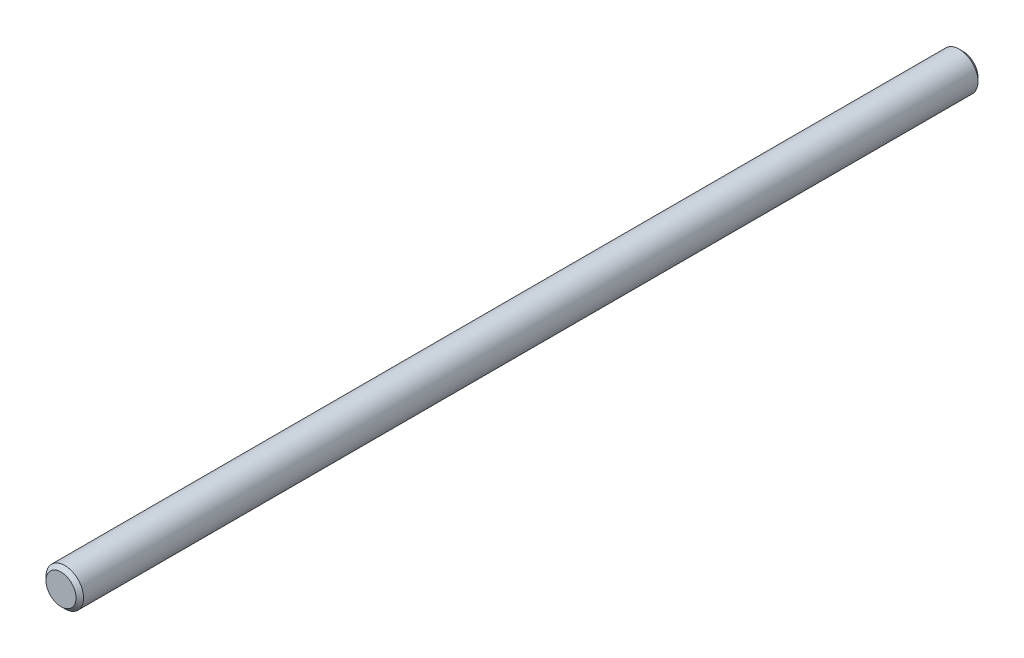
ISO-10303-21;
HEADER;
FILE_DESCRIPTION(('STEP AP214'),'2;1');
FILE_NAME('part.step','',(''),(''),'','','');
FILE_SCHEMA(('AUTOMOTIVE_DESIGN { 1 0 10303 214 1 1 1 1 }'));
ENDSEC;
DATA;
#1=APPLICATION_CONTEXT('core data for automotive mechanical design processes');
#2=APPLICATION_PROTOCOL_DEFINITION('international standard','automotive_design',2000,#1);
#3=PRODUCT_CONTEXT('',#1,'mechanical');
#4=PRODUCT('Part','Part','',(#3));
#5=PRODUCT_RELATED_PRODUCT_CATEGORY('part','',(#4));
#6=PRODUCT_DEFINITION_FORMATION('','',#4);
#7=PRODUCT_DEFINITION_CONTEXT('part definition',#1,'design');
#8=PRODUCT_DEFINITION('design','',#6,#7);
#9=PRODUCT_DEFINITION_SHAPE('','',#8);
#10=(LENGTH_UNIT() NAMED_UNIT(*) SI_UNIT(.MILLI.,.METRE.));
#11=(NAMED_UNIT(*) PLANE_ANGLE_UNIT() SI_UNIT($,.RADIAN.));
#12=(NAMED_UNIT(*) SI_UNIT($,.STERADIAN.) SOLID_ANGLE_UNIT());
#13=UNCERTAINTY_MEASURE_WITH_UNIT(LENGTH_MEASURE(1.E-05),#10,'distance_accuracy_value','');
#14=(GEOMETRIC_REPRESENTATION_CONTEXT(3) GLOBAL_UNCERTAINTY_ASSIGNED_CONTEXT((#13)) GLOBAL_UNIT_ASSIGNED_CONTEXT((#10,
#11,#12)) REPRESENTATION_CONTEXT('',''));
#15=CARTESIAN_POINT('',(0.,0.,0.));
#16=DIRECTION('',(0.,0.,1.));
#17=DIRECTION('',(1.,0.,0.));
#18=AXIS2_PLACEMENT_3D('',#15,#16,#17);
#19=CARTESIAN_POINT('',(0.,0.,76.2));
#20=DIRECTION('',(0.,0.,-1.));
#21=DIRECTION('',(-1.,0.,0.));
#22=AXIS2_PLACEMENT_3D('',#19,#20,#21);
#23=CYLINDRICAL_SURFACE('',#22,3.175);
#24=CARTESIAN_POINT('',(0.,0.,-75.5649999999999));
#25=DIRECTION('',(0.,0.,1.));
#26=DIRECTION('',(1.,0.,0.));
#27=AXIS2_PLACEMENT_3D('',#24,#25,#26);
#28=CIRCLE('',#27,3.175);
#29=CARTESIAN_POINT('',(3.175,0.,-75.5649999999999));
#30=VERTEX_POINT('',#29);
#31=EDGE_CURVE('E46',#30,#30,#28,.T.);
#32=ORIENTED_EDGE('',*,*,#31,.T.);
#33=EDGE_LOOP('',(#32));
#34=FACE_BOUND('',#33,.T.);
#35=CARTESIAN_POINT('',(0.,0.,75.5650000000001));
#36=DIRECTION('',(0.,0.,1.));
#37=DIRECTION('',(1.,0.,0.));
#38=AXIS2_PLACEMENT_3D('',#35,#36,#37);
#39=CIRCLE('',#38,3.175);
#40=CARTESIAN_POINT('',(3.175,0.,75.5650000000001));
#41=VERTEX_POINT('',#40);
#42=EDGE_CURVE('E50',#41,#41,#39,.F.);
#43=ORIENTED_EDGE('',*,*,#42,.T.);
#44=EDGE_LOOP('',(#43));
#45=FACE_BOUND('',#44,.T.);
#46=ADVANCED_FACE('F35',(#34,#45),#23,.T.);
#47=CARTESIAN_POINT('',(0.,0.,76.2));
#48=DIRECTION('',(0.,0.,1.));
#49=DIRECTION('',(1.,0.,0.));
#50=AXIS2_PLACEMENT_3D('',#47,#48,#49);
#51=PLANE('',#50);
#52=CARTESIAN_POINT('',(0.,0.,76.2));
#53=DIRECTION('',(0.,0.,1.));
#54=DIRECTION('',(1.,0.,0.));
#55=AXIS2_PLACEMENT_3D('',#52,#53,#54);
#56=CIRCLE('',#55,2.54000000000008);
#57=CARTESIAN_POINT('',(2.54000000000008,0.,76.2));
#58=VERTEX_POINT('',#57);
#59=EDGE_CURVE('E10',#58,#58,#56,.T.);
#60=ORIENTED_EDGE('',*,*,#59,.T.);
#61=EDGE_LOOP('',(#60));
#62=FACE_BOUND('',#61,.T.);
#63=ADVANCED_FACE('F66',(#62),#51,.T.);
#64=CARTESIAN_POINT('',(0.,0.,-76.2));
#65=DIRECTION('',(0.,0.,1.));
#66=DIRECTION('',(1.,0.,0.));
#67=AXIS2_PLACEMENT_3D('',#64,#65,#66);
#68=PLANE('',#67);
#69=CARTESIAN_POINT('',(0.,0.,-76.2));
#70=DIRECTION('',(0.,0.,1.));
#71=DIRECTION('',(1.,0.,0.));
#72=AXIS2_PLACEMENT_3D('',#69,#70,#71);
#73=CIRCLE('',#72,2.53999999999988);
#74=CARTESIAN_POINT('',(2.53999999999988,0.,-76.2));
#75=VERTEX_POINT('',#74);
#76=EDGE_CURVE('E42',#75,#75,#73,.F.);
#77=ORIENTED_EDGE('',*,*,#76,.T.);
#78=EDGE_LOOP('',(#77));
#79=FACE_BOUND('',#78,.T.);
#80=ADVANCED_FACE('F63',(#79),#68,.F.);
#81=CARTESIAN_POINT('',(0.,0.,-75.5649999999999));
#82=DIRECTION('',(0.,0.,1.));
#83=DIRECTION('',(1.,0.,0.));
#84=AXIS2_PLACEMENT_3D('',#81,#82,#83);
#85=CONICAL_SURFACE('',#84,3.175,0.78539816339744);
#86=ORIENTED_EDGE('',*,*,#76,.F.);
#87=EDGE_LOOP('',(#86));
#88=FACE_BOUND('',#87,.T.);
#89=ORIENTED_EDGE('',*,*,#31,.F.);
#90=EDGE_LOOP('',(#89));
#91=FACE_BOUND('',#90,.T.);
#92=ADVANCED_FACE('F59',(#88,#91),#85,.T.);
#93=CARTESIAN_POINT('',(0.,0.,76.2));
#94=DIRECTION('',(0.,0.,-1.));
#95=DIRECTION('',(-1.,0.,0.));
#96=AXIS2_PLACEMENT_3D('',#93,#94,#95);
#97=CONICAL_SURFACE('',#96,2.54000000000008,0.785398163397451);
#98=ORIENTED_EDGE('',*,*,#42,.F.);
#99=EDGE_LOOP('',(#98));
#100=FACE_BOUND('',#99,.T.);
#101=ORIENTED_EDGE('',*,*,#59,.F.);
#102=EDGE_LOOP('',(#101));
#103=FACE_BOUND('',#102,.T.);
#104=ADVANCED_FACE('F37',(#100,#103),#97,.T.);
#105=CLOSED_SHELL('',(#46,#63,#80,#92,#104));
#106=MANIFOLD_SOLID_BREP('B2',#105);
#107=ADVANCED_BREP_SHAPE_REPRESENTATION('',(#18,#106),#14);
#108=SHAPE_DEFINITION_REPRESENTATION(#9,#107);
ENDSEC;
END-ISO-10303-21;
